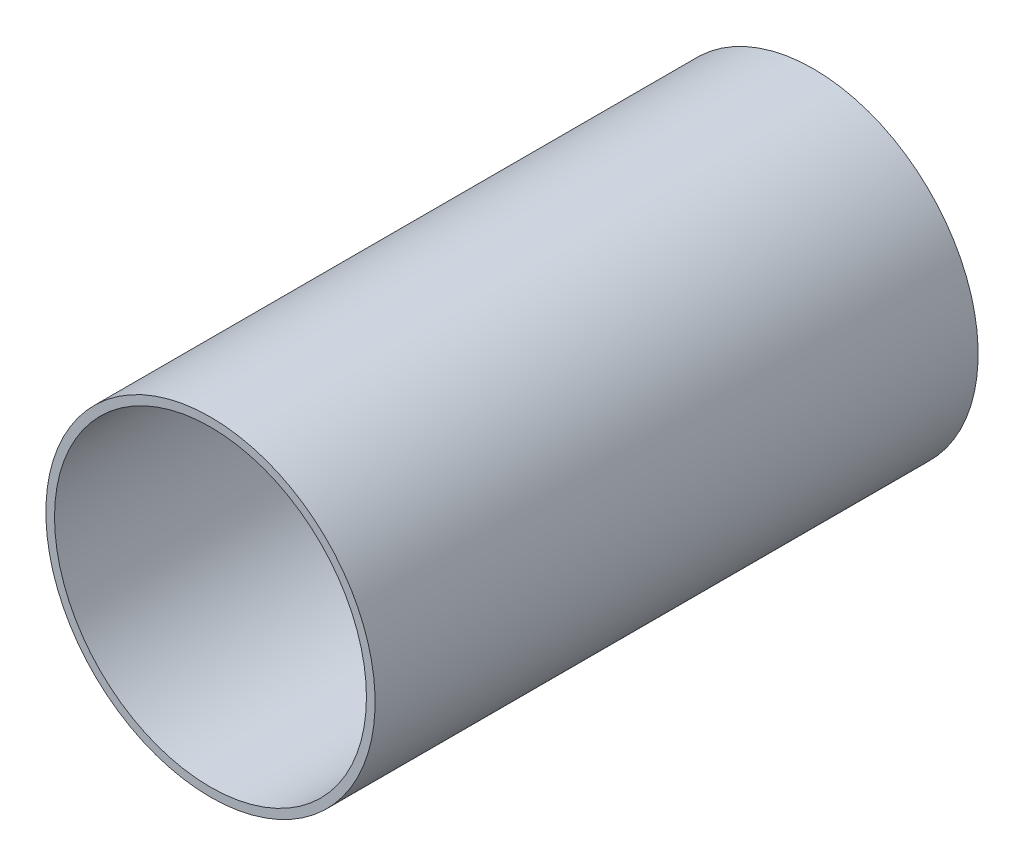
ISO-10303-21;
HEADER;
FILE_DESCRIPTION(('STEP AP214'),'2;1');
FILE_NAME('part.step','',(''),(''),'','','');
FILE_SCHEMA(('AUTOMOTIVE_DESIGN { 1 0 10303 214 1 1 1 1 }'));
ENDSEC;
DATA;
#1=APPLICATION_CONTEXT('core data for automotive mechanical design processes');
#2=APPLICATION_PROTOCOL_DEFINITION('international standard','automotive_design',2000,#1);
#3=PRODUCT_CONTEXT('',#1,'mechanical');
#4=PRODUCT('Part','Part','',(#3));
#5=PRODUCT_RELATED_PRODUCT_CATEGORY('part','',(#4));
#6=PRODUCT_DEFINITION_FORMATION('','',#4);
#7=PRODUCT_DEFINITION_CONTEXT('part definition',#1,'design');
#8=PRODUCT_DEFINITION('design','',#6,#7);
#9=PRODUCT_DEFINITION_SHAPE('','',#8);
#10=(LENGTH_UNIT() NAMED_UNIT(*) SI_UNIT(.MILLI.,.METRE.));
#11=(NAMED_UNIT(*) PLANE_ANGLE_UNIT() SI_UNIT($,.RADIAN.));
#12=(NAMED_UNIT(*) SI_UNIT($,.STERADIAN.) SOLID_ANGLE_UNIT());
#13=UNCERTAINTY_MEASURE_WITH_UNIT(LENGTH_MEASURE(1.E-05),#10,'distance_accuracy_value','');
#14=(GEOMETRIC_REPRESENTATION_CONTEXT(3) GLOBAL_UNCERTAINTY_ASSIGNED_CONTEXT((#13)) GLOBAL_UNIT_ASSIGNED_CONTEXT((#10,
#11,#12)) REPRESENTATION_CONTEXT('',''));
#15=CARTESIAN_POINT('',(0.,0.,0.));
#16=DIRECTION('',(0.,0.,1.));
#17=DIRECTION('',(1.,0.,0.));
#18=AXIS2_PLACEMENT_3D('',#15,#16,#17);
#19=CARTESIAN_POINT('',(177.26,-129.456,-0.045));
#20=DIRECTION('',(0.,0.,-1.));
#21=DIRECTION('',(0.,-1.,0.));
#22=AXIS2_PLACEMENT_3D('',#19,#20,#21);
#23=CYLINDRICAL_SURFACE('',#22,0.45);
#24=CARTESIAN_POINT('',(177.26,-129.456,-0.035));
#25=DIRECTION('',(0.,0.,-1.));
#26=DIRECTION('',(0.,-1.,0.));
#27=AXIS2_PLACEMENT_3D('',#24,#25,#26);
#28=CIRCLE('',#27,0.45);
#29=CARTESIAN_POINT('',(177.26,-129.906,-0.035));
#30=VERTEX_POINT('',#29);
#31=EDGE_CURVE('E63',#30,#30,#28,.T.);
#32=ORIENTED_EDGE('',*,*,#31,.T.);
#33=DIRECTION('',(0.,0.,1.));
#34=VECTOR('',#33,1.);
#35=CARTESIAN_POINT('',(177.26,-129.906,-0.045));
#36=LINE('',#35,#34);
#37=CARTESIAN_POINT('',(177.26,-129.906,1.705));
#38=VERTEX_POINT('',#37);
#39=EDGE_CURVE('E11',#30,#38,#36,.T.);
#40=ORIENTED_EDGE('',*,*,#39,.T.);
#41=CARTESIAN_POINT('',(177.26,-129.456,1.705));
#42=DIRECTION('',(0.,0.,-1.));
#43=DIRECTION('',(0.,-1.,0.));
#44=AXIS2_PLACEMENT_3D('',#41,#42,#43);
#45=CIRCLE('',#44,0.45);
#46=EDGE_CURVE('E20',#38,#38,#45,.T.);
#47=ORIENTED_EDGE('',*,*,#46,.F.);
#48=ORIENTED_EDGE('',*,*,#39,.F.);
#49=EDGE_LOOP('',(#32,#40,#47,#48));
#50=FACE_BOUND('',#49,.T.);
#51=ADVANCED_FACE('F17',(#50),#23,.F.);
#52=CARTESIAN_POINT('',(177.26,-129.931,1.705));
#53=DIRECTION('',(0.,0.,1.));
#54=DIRECTION('',(1.,0.,0.));
#55=AXIS2_PLACEMENT_3D('',#52,#53,#54);
#56=PLANE('',#55);
#57=ORIENTED_EDGE('',*,*,#46,.T.);
#58=EDGE_LOOP('',(#57));
#59=FACE_BOUND('',#58,.T.);
#60=CARTESIAN_POINT('',(177.26,-129.456,1.705));
#61=DIRECTION('',(0.,0.,1.));
#62=DIRECTION('',(0.,-1.,0.));
#63=AXIS2_PLACEMENT_3D('',#60,#61,#62);
#64=CIRCLE('',#63,0.475);
#65=CARTESIAN_POINT('',(177.26,-129.931,1.705));
#66=VERTEX_POINT('',#65);
#67=EDGE_CURVE('E55',#66,#66,#64,.T.);
#68=ORIENTED_EDGE('',*,*,#67,.T.);
#69=EDGE_LOOP('',(#68));
#70=FACE_BOUND('',#69,.T.);
#71=ADVANCED_FACE('F74',(#59,#70),#56,.T.);
#72=CARTESIAN_POINT('',(177.26,-129.931,-0.035));
#73=DIRECTION('',(0.,0.,1.));
#74=DIRECTION('',(1.,0.,0.));
#75=AXIS2_PLACEMENT_3D('',#72,#73,#74);
#76=PLANE('',#75);
#77=ORIENTED_EDGE('',*,*,#31,.F.);
#78=EDGE_LOOP('',(#77));
#79=FACE_BOUND('',#78,.T.);
#80=CARTESIAN_POINT('',(177.26,-129.456,-0.035));
#81=DIRECTION('',(0.,0.,1.));
#82=DIRECTION('',(0.,-1.,0.));
#83=AXIS2_PLACEMENT_3D('',#80,#81,#82);
#84=CIRCLE('',#83,0.475);
#85=CARTESIAN_POINT('',(177.26,-129.931,-0.035));
#86=VERTEX_POINT('',#85);
#87=EDGE_CURVE('E54',#86,#86,#84,.T.);
#88=ORIENTED_EDGE('',*,*,#87,.F.);
#89=EDGE_LOOP('',(#88));
#90=FACE_BOUND('',#89,.T.);
#91=ADVANCED_FACE('F82',(#79,#90),#76,.F.);
#92=CARTESIAN_POINT('',(177.26,-129.456,-0.035));
#93=DIRECTION('',(0.,0.,-1.));
#94=DIRECTION('',(0.,-1.,0.));
#95=AXIS2_PLACEMENT_3D('',#92,#93,#94);
#96=CYLINDRICAL_SURFACE('',#95,0.475);
#97=ORIENTED_EDGE('',*,*,#87,.T.);
#98=DIRECTION('',(0.,0.,1.));
#99=VECTOR('',#98,1.);
#100=CARTESIAN_POINT('',(177.26,-129.931,-0.035));
#101=LINE('',#100,#99);
#102=EDGE_CURVE('E51',#86,#66,#101,.T.);
#103=ORIENTED_EDGE('',*,*,#102,.T.);
#104=ORIENTED_EDGE('',*,*,#67,.F.);
#105=ORIENTED_EDGE('',*,*,#102,.F.);
#106=EDGE_LOOP('',(#97,#103,#104,#105));
#107=FACE_BOUND('',#106,.T.);
#108=ADVANCED_FACE('F52',(#107),#96,.T.);
#109=CLOSED_SHELL('',(#51,#71,#91,#108));
#110=MANIFOLD_SOLID_BREP('B1',#109);
#111=ADVANCED_BREP_SHAPE_REPRESENTATION('',(#18,#110),#14);
#112=SHAPE_DEFINITION_REPRESENTATION(#9,#111);
ENDSEC;
END-ISO-10303-21;
